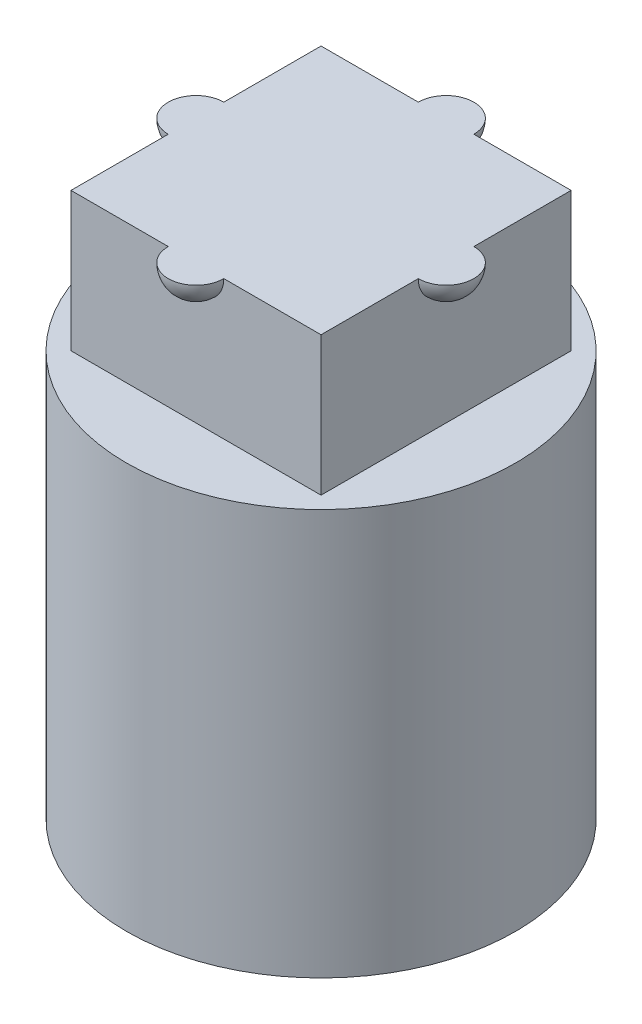
ISO-10303-21;
HEADER;
FILE_DESCRIPTION(('STEP AP214'),'2;1');
FILE_NAME('part.step','',(''),(''),'','','');
FILE_SCHEMA(('AUTOMOTIVE_DESIGN { 1 0 10303 214 1 1 1 1 }'));
ENDSEC;
DATA;
#1=APPLICATION_CONTEXT('core data for automotive mechanical design processes');
#2=APPLICATION_PROTOCOL_DEFINITION('international standard','automotive_design',2000,#1);
#3=PRODUCT_CONTEXT('',#1,'mechanical');
#4=PRODUCT('Part','Part','',(#3));
#5=PRODUCT_RELATED_PRODUCT_CATEGORY('part','',(#4));
#6=PRODUCT_DEFINITION_FORMATION('','',#4);
#7=PRODUCT_DEFINITION_CONTEXT('part definition',#1,'design');
#8=PRODUCT_DEFINITION('design','',#6,#7);
#9=PRODUCT_DEFINITION_SHAPE('','',#8);
#10=(LENGTH_UNIT() NAMED_UNIT(*) SI_UNIT(.MILLI.,.METRE.));
#11=(NAMED_UNIT(*) PLANE_ANGLE_UNIT() SI_UNIT($,.RADIAN.));
#12=(NAMED_UNIT(*) SI_UNIT($,.STERADIAN.) SOLID_ANGLE_UNIT());
#13=UNCERTAINTY_MEASURE_WITH_UNIT(LENGTH_MEASURE(1.E-05),#10,'distance_accuracy_value','');
#14=(GEOMETRIC_REPRESENTATION_CONTEXT(3) GLOBAL_UNCERTAINTY_ASSIGNED_CONTEXT((#13)) GLOBAL_UNIT_ASSIGNED_CONTEXT((#10,
#11,#12)) REPRESENTATION_CONTEXT('',''));
#15=CARTESIAN_POINT('',(0.,0.,0.));
#16=DIRECTION('',(0.,0.,1.));
#17=DIRECTION('',(1.,0.,0.));
#18=AXIS2_PLACEMENT_3D('',#15,#16,#17);
#19=CARTESIAN_POINT('',(2.25,9.8,0.));
#20=DIRECTION('',(-1.,0.,0.));
#21=DIRECTION('',(0.,0.,1.));
#22=AXIS2_PLACEMENT_3D('',#19,#20,#21);
#23=SPHERICAL_SURFACE('',#22,0.5);
#24=CARTESIAN_POINT('',(2.25,9.8,0.));
#25=DIRECTION('',(-1.,0.,0.));
#26=DIRECTION('',(0.,0.,1.));
#27=AXIS2_PLACEMENT_3D('',#24,#25,#26);
#28=CIRCLE('',#27,0.5);
#29=CARTESIAN_POINT('',(2.25,9.8,-0.5));
#30=VERTEX_POINT('',#29);
#31=CARTESIAN_POINT('',(2.25,9.8,0.5));
#32=VERTEX_POINT('',#31);
#33=EDGE_CURVE('E173',#30,#32,#28,.T.);
#34=ORIENTED_EDGE('',*,*,#33,.F.);
#35=CARTESIAN_POINT('',(2.25,9.8,0.));
#36=DIRECTION('',(0.,1.,0.));
#37=DIRECTION('',(0.,0.,1.));
#38=AXIS2_PLACEMENT_3D('',#35,#36,#37);
#39=CIRCLE('',#38,0.5);
#40=EDGE_CURVE('E484',#30,#32,#39,.F.);
#41=ORIENTED_EDGE('',*,*,#40,.T.);
#42=EDGE_LOOP('',(#34,#41));
#43=FACE_BOUND('',#42,.T.);
#44=ADVANCED_FACE('F35',(#43),#23,.T.);
#45=CARTESIAN_POINT('',(-2.25,9.8,0.));
#46=DIRECTION('',(-1.,0.,0.));
#47=DIRECTION('',(0.,0.,1.));
#48=AXIS2_PLACEMENT_3D('',#45,#46,#47);
#49=SPHERICAL_SURFACE('',#48,0.5);
#50=CARTESIAN_POINT('',(-2.25,9.8,0.));
#51=DIRECTION('',(1.,0.,0.));
#52=DIRECTION('',(0.,0.,-1.));
#53=AXIS2_PLACEMENT_3D('',#50,#51,#52);
#54=CIRCLE('',#53,0.5);
#55=CARTESIAN_POINT('',(-2.25,9.8,0.5));
#56=VERTEX_POINT('',#55);
#57=CARTESIAN_POINT('',(-2.25,9.8,-0.5));
#58=VERTEX_POINT('',#57);
#59=EDGE_CURVE('E491',#56,#58,#54,.T.);
#60=ORIENTED_EDGE('',*,*,#59,.F.);
#61=CARTESIAN_POINT('',(-2.25,9.8,0.));
#62=DIRECTION('',(0.,1.,0.));
#63=DIRECTION('',(0.,0.,1.));
#64=AXIS2_PLACEMENT_3D('',#61,#62,#63);
#65=CIRCLE('',#64,0.5);
#66=EDGE_CURVE('E57',#56,#58,#65,.F.);
#67=ORIENTED_EDGE('',*,*,#66,.T.);
#68=EDGE_LOOP('',(#60,#67));
#69=FACE_BOUND('',#68,.T.);
#70=ADVANCED_FACE('F307',(#69),#49,.T.);
#71=CARTESIAN_POINT('',(0.,9.8,-2.25));
#72=DIRECTION('',(0.,0.,1.));
#73=DIRECTION('',(1.,0.,0.));
#74=AXIS2_PLACEMENT_3D('',#71,#72,#73);
#75=SPHERICAL_SURFACE('',#74,0.5);
#76=CARTESIAN_POINT('',(0.,9.8,-2.25));
#77=DIRECTION('',(0.,1.,0.));
#78=DIRECTION('',(0.,0.,1.));
#79=AXIS2_PLACEMENT_3D('',#76,#77,#78);
#80=CIRCLE('',#79,0.5);
#81=CARTESIAN_POINT('',(0.499999999999999,9.8,-2.25));
#82=VERTEX_POINT('',#81);
#83=CARTESIAN_POINT('',(-0.500000000000001,9.8,-2.25));
#84=VERTEX_POINT('',#83);
#85=EDGE_CURVE('E50',#82,#84,#80,.T.);
#86=ORIENTED_EDGE('',*,*,#85,.F.);
#87=CARTESIAN_POINT('',(0.,9.8,-2.25));
#88=DIRECTION('',(0.,0.,1.));
#89=DIRECTION('',(1.,0.,0.));
#90=AXIS2_PLACEMENT_3D('',#87,#88,#89);
#91=CIRCLE('',#90,0.5);
#92=EDGE_CURVE('E157',#82,#84,#91,.F.);
#93=ORIENTED_EDGE('',*,*,#92,.T.);
#94=EDGE_LOOP('',(#86,#93));
#95=FACE_BOUND('',#94,.T.);
#96=ADVANCED_FACE('F313',(#95),#75,.T.);
#97=CARTESIAN_POINT('',(0.,9.8,2.25));
#98=DIRECTION('',(0.,0.,1.));
#99=DIRECTION('',(1.,0.,0.));
#100=AXIS2_PLACEMENT_3D('',#97,#98,#99);
#101=SPHERICAL_SURFACE('',#100,0.5);
#102=CARTESIAN_POINT('',(0.,9.8,2.25));
#103=DIRECTION('',(0.,1.,0.));
#104=DIRECTION('',(0.,0.,1.));
#105=AXIS2_PLACEMENT_3D('',#102,#103,#104);
#106=CIRCLE('',#105,0.5);
#107=CARTESIAN_POINT('',(-0.500000000000001,9.8,2.25));
#108=VERTEX_POINT('',#107);
#109=CARTESIAN_POINT('',(0.499999999999999,9.8,2.25));
#110=VERTEX_POINT('',#109);
#111=EDGE_CURVE('E11',#108,#110,#106,.T.);
#112=ORIENTED_EDGE('',*,*,#111,.F.);
#113=CARTESIAN_POINT('',(0.,9.8,2.25));
#114=DIRECTION('',(0.,0.,-1.));
#115=DIRECTION('',(-1.,0.,0.));
#116=AXIS2_PLACEMENT_3D('',#113,#114,#115);
#117=CIRCLE('',#116,0.5);
#118=EDGE_CURVE('E154',#108,#110,#117,.F.);
#119=ORIENTED_EDGE('',*,*,#118,.T.);
#120=EDGE_LOOP('',(#112,#119));
#121=FACE_BOUND('',#120,.T.);
#122=ADVANCED_FACE('F155',(#121),#101,.T.);
#123=CARTESIAN_POINT('',(0.,7.3,0.));
#124=DIRECTION('',(0.,1.,0.));
#125=DIRECTION('',(0.,0.,1.));
#126=AXIS2_PLACEMENT_3D('',#123,#124,#125);
#127=PLANE('',#126);
#128=CARTESIAN_POINT('',(0.,7.3,0.));
#129=DIRECTION('',(0.,1.,0.));
#130=DIRECTION('',(0.,0.,1.));
#131=AXIS2_PLACEMENT_3D('',#128,#129,#130);
#132=CIRCLE('',#131,3.5);
#133=CARTESIAN_POINT('',(0.,7.3,3.5));
#134=VERTEX_POINT('',#133);
#135=EDGE_CURVE('E189',#134,#134,#132,.T.);
#136=ORIENTED_EDGE('',*,*,#135,.T.);
#137=EDGE_LOOP('',(#136));
#138=FACE_BOUND('',#137,.T.);
#139=DIRECTION('',(-1.,0.,0.));
#140=VECTOR('',#139,1.);
#141=CARTESIAN_POINT('',(-2.25,7.3,-2.25));
#142=LINE('',#141,#140);
#143=CARTESIAN_POINT('',(2.25,7.3,-2.25));
#144=VERTEX_POINT('',#143);
#145=CARTESIAN_POINT('',(-2.25,7.3,-2.25));
#146=VERTEX_POINT('',#145);
#147=EDGE_CURVE('E172',#144,#146,#142,.T.);
#148=ORIENTED_EDGE('',*,*,#147,.F.);
#149=DIRECTION('',(0.,0.,-1.));
#150=VECTOR('',#149,1.);
#151=CARTESIAN_POINT('',(2.25,7.3,-2.25));
#152=LINE('',#151,#150);
#153=CARTESIAN_POINT('',(2.25,7.3,2.25));
#154=VERTEX_POINT('',#153);
#155=EDGE_CURVE('E169',#154,#144,#152,.T.);
#156=ORIENTED_EDGE('',*,*,#155,.F.);
#157=DIRECTION('',(1.,0.,0.));
#158=VECTOR('',#157,1.);
#159=CARTESIAN_POINT('',(-2.25,7.3,2.25));
#160=LINE('',#159,#158);
#161=CARTESIAN_POINT('',(-2.25,7.3,2.25));
#162=VERTEX_POINT('',#161);
#163=EDGE_CURVE('E178',#162,#154,#160,.T.);
#164=ORIENTED_EDGE('',*,*,#163,.F.);
#165=DIRECTION('',(0.,0.,1.));
#166=VECTOR('',#165,1.);
#167=CARTESIAN_POINT('',(-2.25,7.3,-2.25));
#168=LINE('',#167,#166);
#169=EDGE_CURVE('E175',#146,#162,#168,.T.);
#170=ORIENTED_EDGE('',*,*,#169,.F.);
#171=EDGE_LOOP('',(#148,#156,#164,#170));
#172=FACE_BOUND('',#171,.T.);
#173=ADVANCED_FACE('F265',(#138,#172),#127,.T.);
#174=CARTESIAN_POINT('',(0.,0.,0.));
#175=DIRECTION('',(0.,1.,0.));
#176=DIRECTION('',(0.,0.,1.));
#177=AXIS2_PLACEMENT_3D('',#174,#175,#176);
#178=PLANE('',#177);
#179=CARTESIAN_POINT('',(0.,0.,0.));
#180=DIRECTION('',(0.,1.,0.));
#181=DIRECTION('',(0.,0.,1.));
#182=AXIS2_PLACEMENT_3D('',#179,#180,#181);
#183=CIRCLE('',#182,3.5);
#184=CARTESIAN_POINT('',(0.,0.,3.5));
#185=VERTEX_POINT('',#184);
#186=EDGE_CURVE('E43',#185,#185,#183,.T.);
#187=ORIENTED_EDGE('',*,*,#186,.F.);
#188=EDGE_LOOP('',(#187));
#189=FACE_BOUND('',#188,.T.);
#190=CARTESIAN_POINT('',(1.2,0.,-1.2));
#191=DIRECTION('',(0.,1.,0.));
#192=DIRECTION('',(0.,0.,1.));
#193=AXIS2_PLACEMENT_3D('',#190,#191,#192);
#194=CIRCLE('',#193,0.25);
#195=CARTESIAN_POINT('',(1.2,0.,-0.950000000000001));
#196=VERTEX_POINT('',#195);
#197=CARTESIAN_POINT('',(0.95,0.,-1.2));
#198=VERTEX_POINT('',#197);
#199=EDGE_CURVE('E192',#196,#198,#194,.T.);
#200=ORIENTED_EDGE('',*,*,#199,.T.);
#201=DIRECTION('',(-1.,0.,0.));
#202=VECTOR('',#201,1.);
#203=CARTESIAN_POINT('',(0.95,0.,-1.2));
#204=LINE('',#203,#202);
#205=CARTESIAN_POINT('',(-0.95,0.,-1.2));
#206=VERTEX_POINT('',#205);
#207=EDGE_CURVE('E221',#198,#206,#204,.T.);
#208=ORIENTED_EDGE('',*,*,#207,.T.);
#209=CARTESIAN_POINT('',(-1.2,0.,-1.2));
#210=DIRECTION('',(0.,1.,0.));
#211=DIRECTION('',(0.,0.,1.));
#212=AXIS2_PLACEMENT_3D('',#209,#210,#211);
#213=CIRCLE('',#212,0.25);
#214=CARTESIAN_POINT('',(-1.2,0.,-0.95));
#215=VERTEX_POINT('',#214);
#216=EDGE_CURVE('E224',#206,#215,#213,.T.);
#217=ORIENTED_EDGE('',*,*,#216,.T.);
#218=DIRECTION('',(0.,0.,1.));
#219=VECTOR('',#218,1.);
#220=CARTESIAN_POINT('',(-1.2,0.,0.95));
#221=LINE('',#220,#219);
#222=CARTESIAN_POINT('',(-1.2,0.,0.95));
#223=VERTEX_POINT('',#222);
#224=EDGE_CURVE('E227',#215,#223,#221,.T.);
#225=ORIENTED_EDGE('',*,*,#224,.T.);
#226=CARTESIAN_POINT('',(-1.2,0.,1.2));
#227=DIRECTION('',(0.,1.,0.));
#228=DIRECTION('',(0.,0.,1.));
#229=AXIS2_PLACEMENT_3D('',#226,#227,#228);
#230=CIRCLE('',#229,0.25);
#231=CARTESIAN_POINT('',(-0.95,0.,1.2));
#232=VERTEX_POINT('',#231);
#233=EDGE_CURVE('E230',#223,#232,#230,.T.);
#234=ORIENTED_EDGE('',*,*,#233,.T.);
#235=DIRECTION('',(1.,0.,0.));
#236=VECTOR('',#235,1.);
#237=CARTESIAN_POINT('',(0.95,0.,1.2));
#238=LINE('',#237,#236);
#239=CARTESIAN_POINT('',(0.95,0.,1.2));
#240=VERTEX_POINT('',#239);
#241=EDGE_CURVE('E233',#232,#240,#238,.T.);
#242=ORIENTED_EDGE('',*,*,#241,.T.);
#243=CARTESIAN_POINT('',(1.2,0.,1.2));
#244=DIRECTION('',(0.,1.,0.));
#245=DIRECTION('',(0.,0.,1.));
#246=AXIS2_PLACEMENT_3D('',#243,#244,#245);
#247=CIRCLE('',#246,0.25);
#248=CARTESIAN_POINT('',(1.2,0.,0.949999999999999));
#249=VERTEX_POINT('',#248);
#250=EDGE_CURVE('E236',#240,#249,#247,.T.);
#251=ORIENTED_EDGE('',*,*,#250,.T.);
#252=DIRECTION('',(0.,0.,-1.));
#253=VECTOR('',#252,1.);
#254=CARTESIAN_POINT('',(1.2,0.,0.949999999999999));
#255=LINE('',#254,#253);
#256=EDGE_CURVE('E197',#249,#196,#255,.T.);
#257=ORIENTED_EDGE('',*,*,#256,.T.);
#258=EDGE_LOOP('',(#200,#208,#217,#225,#234,#242,#251,#257));
#259=FACE_BOUND('',#258,.T.);
#260=ADVANCED_FACE('F262',(#189,#259),#178,.F.);
#261=CARTESIAN_POINT('',(0.,4.,0.));
#262=DIRECTION('',(0.,-1.,0.));
#263=DIRECTION('',(0.,0.,-1.));
#264=AXIS2_PLACEMENT_3D('',#261,#262,#263);
#265=CYLINDRICAL_SURFACE('',#264,3.5);
#266=ORIENTED_EDGE('',*,*,#186,.T.);
#267=EDGE_LOOP('',(#266));
#268=FACE_BOUND('',#267,.T.);
#269=ORIENTED_EDGE('',*,*,#135,.F.);
#270=EDGE_LOOP('',(#269));
#271=FACE_BOUND('',#270,.T.);
#272=ADVANCED_FACE('F37',(#268,#271),#265,.T.);
#273=CARTESIAN_POINT('',(1.2,4.,-1.2));
#274=DIRECTION('',(0.,-1.,0.));
#275=DIRECTION('',(0.,0.,-1.));
#276=AXIS2_PLACEMENT_3D('',#273,#274,#275);
#277=CYLINDRICAL_SURFACE('',#276,0.25);
#278=ORIENTED_EDGE('',*,*,#199,.F.);
#279=DIRECTION('',(0.,-1.,0.));
#280=VECTOR('',#279,1.);
#281=CARTESIAN_POINT('',(1.2,4.,-0.950000000000001));
#282=LINE('',#281,#280);
#283=CARTESIAN_POINT('',(1.2,4.,-0.950000000000001));
#284=VERTEX_POINT('',#283);
#285=EDGE_CURVE('E218',#284,#196,#282,.T.);
#286=ORIENTED_EDGE('',*,*,#285,.F.);
#287=CARTESIAN_POINT('',(1.2,4.,-1.2));
#288=DIRECTION('',(0.,1.,0.));
#289=DIRECTION('',(0.,0.,1.));
#290=AXIS2_PLACEMENT_3D('',#287,#288,#289);
#291=CIRCLE('',#290,0.25);
#292=CARTESIAN_POINT('',(0.95,4.,-1.2));
#293=VERTEX_POINT('',#292);
#294=EDGE_CURVE('E193',#284,#293,#291,.T.);
#295=ORIENTED_EDGE('',*,*,#294,.T.);
#296=DIRECTION('',(0.,-1.,0.));
#297=VECTOR('',#296,1.);
#298=CARTESIAN_POINT('',(0.95,4.,-1.2));
#299=LINE('',#298,#297);
#300=EDGE_CURVE('E255',#293,#198,#299,.T.);
#301=ORIENTED_EDGE('',*,*,#300,.T.);
#302=EDGE_LOOP('',(#278,#286,#295,#301));
#303=FACE_BOUND('',#302,.T.);
#304=ADVANCED_FACE('F269',(#303),#277,.F.);
#305=CARTESIAN_POINT('',(0.95,4.,-1.2));
#306=DIRECTION('',(0.,0.,1.));
#307=DIRECTION('',(1.,0.,0.));
#308=AXIS2_PLACEMENT_3D('',#305,#306,#307);
#309=PLANE('',#308);
#310=ORIENTED_EDGE('',*,*,#207,.F.);
#311=ORIENTED_EDGE('',*,*,#300,.F.);
#312=DIRECTION('',(-1.,0.,0.));
#313=VECTOR('',#312,1.);
#314=CARTESIAN_POINT('',(0.95,4.,-1.2));
#315=LINE('',#314,#313);
#316=CARTESIAN_POINT('',(-0.95,4.,-1.2));
#317=VERTEX_POINT('',#316);
#318=EDGE_CURVE('E196',#293,#317,#315,.T.);
#319=ORIENTED_EDGE('',*,*,#318,.T.);
#320=DIRECTION('',(0.,-1.,0.));
#321=VECTOR('',#320,1.);
#322=CARTESIAN_POINT('',(-0.95,4.,-1.2));
#323=LINE('',#322,#321);
#324=EDGE_CURVE('E253',#317,#206,#323,.T.);
#325=ORIENTED_EDGE('',*,*,#324,.T.);
#326=EDGE_LOOP('',(#310,#311,#319,#325));
#327=FACE_BOUND('',#326,.T.);
#328=ADVANCED_FACE('F277',(#327),#309,.T.);
#329=CARTESIAN_POINT('',(-1.2,4.,-1.2));
#330=DIRECTION('',(0.,-1.,0.));
#331=DIRECTION('',(0.,0.,-1.));
#332=AXIS2_PLACEMENT_3D('',#329,#330,#331);
#333=CYLINDRICAL_SURFACE('',#332,0.25);
#334=ORIENTED_EDGE('',*,*,#216,.F.);
#335=ORIENTED_EDGE('',*,*,#324,.F.);
#336=CARTESIAN_POINT('',(-1.2,4.,-1.2));
#337=DIRECTION('',(0.,1.,0.));
#338=DIRECTION('',(0.,0.,1.));
#339=AXIS2_PLACEMENT_3D('',#336,#337,#338);
#340=CIRCLE('',#339,0.25);
#341=CARTESIAN_POINT('',(-1.2,4.,-0.95));
#342=VERTEX_POINT('',#341);
#343=EDGE_CURVE('E200',#317,#342,#340,.T.);
#344=ORIENTED_EDGE('',*,*,#343,.T.);
#345=DIRECTION('',(0.,-1.,0.));
#346=VECTOR('',#345,1.);
#347=CARTESIAN_POINT('',(-1.2,4.,-0.95));
#348=LINE('',#347,#346);
#349=EDGE_CURVE('E251',#342,#215,#348,.T.);
#350=ORIENTED_EDGE('',*,*,#349,.T.);
#351=EDGE_LOOP('',(#334,#335,#344,#350));
#352=FACE_BOUND('',#351,.T.);
#353=ADVANCED_FACE('F281',(#352),#333,.F.);
#354=CARTESIAN_POINT('',(-1.2,4.,0.95));
#355=DIRECTION('',(1.,0.,0.));
#356=DIRECTION('',(0.,0.,-1.));
#357=AXIS2_PLACEMENT_3D('',#354,#355,#356);
#358=PLANE('',#357);
#359=ORIENTED_EDGE('',*,*,#224,.F.);
#360=ORIENTED_EDGE('',*,*,#349,.F.);
#361=DIRECTION('',(0.,0.,1.));
#362=VECTOR('',#361,1.);
#363=CARTESIAN_POINT('',(-1.2,4.,0.95));
#364=LINE('',#363,#362);
#365=CARTESIAN_POINT('',(-1.2,4.,0.95));
#366=VERTEX_POINT('',#365);
#367=EDGE_CURVE('E203',#342,#366,#364,.T.);
#368=ORIENTED_EDGE('',*,*,#367,.T.);
#369=DIRECTION('',(0.,-1.,0.));
#370=VECTOR('',#369,1.);
#371=CARTESIAN_POINT('',(-1.2,4.,0.95));
#372=LINE('',#371,#370);
#373=EDGE_CURVE('E249',#366,#223,#372,.T.);
#374=ORIENTED_EDGE('',*,*,#373,.T.);
#375=EDGE_LOOP('',(#359,#360,#368,#374));
#376=FACE_BOUND('',#375,.T.);
#377=ADVANCED_FACE('F286',(#376),#358,.T.);
#378=CARTESIAN_POINT('',(-1.2,4.,1.2));
#379=DIRECTION('',(0.,-1.,0.));
#380=DIRECTION('',(0.,0.,-1.));
#381=AXIS2_PLACEMENT_3D('',#378,#379,#380);
#382=CYLINDRICAL_SURFACE('',#381,0.25);
#383=ORIENTED_EDGE('',*,*,#233,.F.);
#384=ORIENTED_EDGE('',*,*,#373,.F.);
#385=CARTESIAN_POINT('',(-1.2,4.,1.2));
#386=DIRECTION('',(0.,1.,0.));
#387=DIRECTION('',(0.,0.,1.));
#388=AXIS2_PLACEMENT_3D('',#385,#386,#387);
#389=CIRCLE('',#388,0.25);
#390=CARTESIAN_POINT('',(-0.95,4.,1.2));
#391=VERTEX_POINT('',#390);
#392=EDGE_CURVE('E206',#366,#391,#389,.T.);
#393=ORIENTED_EDGE('',*,*,#392,.T.);
#394=DIRECTION('',(0.,-1.,0.));
#395=VECTOR('',#394,1.);
#396=CARTESIAN_POINT('',(-0.95,4.,1.2));
#397=LINE('',#396,#395);
#398=EDGE_CURVE('E247',#391,#232,#397,.T.);
#399=ORIENTED_EDGE('',*,*,#398,.T.);
#400=EDGE_LOOP('',(#383,#384,#393,#399));
#401=FACE_BOUND('',#400,.T.);
#402=ADVANCED_FACE('F289',(#401),#382,.F.);
#403=CARTESIAN_POINT('',(0.95,4.,1.2));
#404=DIRECTION('',(0.,0.,-1.));
#405=DIRECTION('',(-1.,0.,0.));
#406=AXIS2_PLACEMENT_3D('',#403,#404,#405);
#407=PLANE('',#406);
#408=ORIENTED_EDGE('',*,*,#241,.F.);
#409=ORIENTED_EDGE('',*,*,#398,.F.);
#410=DIRECTION('',(1.,0.,0.));
#411=VECTOR('',#410,1.);
#412=CARTESIAN_POINT('',(0.95,4.,1.2));
#413=LINE('',#412,#411);
#414=CARTESIAN_POINT('',(0.95,4.,1.2));
#415=VERTEX_POINT('',#414);
#416=EDGE_CURVE('E209',#391,#415,#413,.T.);
#417=ORIENTED_EDGE('',*,*,#416,.T.);
#418=DIRECTION('',(0.,-1.,0.));
#419=VECTOR('',#418,1.);
#420=CARTESIAN_POINT('',(0.95,4.,1.2));
#421=LINE('',#420,#419);
#422=EDGE_CURVE('E245',#415,#240,#421,.T.);
#423=ORIENTED_EDGE('',*,*,#422,.T.);
#424=EDGE_LOOP('',(#408,#409,#417,#423));
#425=FACE_BOUND('',#424,.T.);
#426=ADVANCED_FACE('F293',(#425),#407,.T.);
#427=CARTESIAN_POINT('',(1.2,4.,1.2));
#428=DIRECTION('',(0.,-1.,0.));
#429=DIRECTION('',(0.,0.,-1.));
#430=AXIS2_PLACEMENT_3D('',#427,#428,#429);
#431=CYLINDRICAL_SURFACE('',#430,0.25);
#432=ORIENTED_EDGE('',*,*,#250,.F.);
#433=ORIENTED_EDGE('',*,*,#422,.F.);
#434=CARTESIAN_POINT('',(1.2,4.,1.2));
#435=DIRECTION('',(0.,1.,0.));
#436=DIRECTION('',(0.,0.,1.));
#437=AXIS2_PLACEMENT_3D('',#434,#435,#436);
#438=CIRCLE('',#437,0.25);
#439=CARTESIAN_POINT('',(1.2,4.,0.949999999999999));
#440=VERTEX_POINT('',#439);
#441=EDGE_CURVE('E212',#415,#440,#438,.T.);
#442=ORIENTED_EDGE('',*,*,#441,.T.);
#443=DIRECTION('',(0.,-1.,0.));
#444=VECTOR('',#443,1.);
#445=CARTESIAN_POINT('',(1.2,4.,0.949999999999999));
#446=LINE('',#445,#444);
#447=EDGE_CURVE('E243',#440,#249,#446,.T.);
#448=ORIENTED_EDGE('',*,*,#447,.T.);
#449=EDGE_LOOP('',(#432,#433,#442,#448));
#450=FACE_BOUND('',#449,.T.);
#451=ADVANCED_FACE('F297',(#450),#431,.F.);
#452=CARTESIAN_POINT('',(1.2,4.,0.949999999999999));
#453=DIRECTION('',(-1.,0.,0.));
#454=DIRECTION('',(0.,0.,1.));
#455=AXIS2_PLACEMENT_3D('',#452,#453,#454);
#456=PLANE('',#455);
#457=ORIENTED_EDGE('',*,*,#256,.F.);
#458=ORIENTED_EDGE('',*,*,#447,.F.);
#459=DIRECTION('',(0.,0.,-1.));
#460=VECTOR('',#459,1.);
#461=CARTESIAN_POINT('',(1.2,4.,0.949999999999999));
#462=LINE('',#461,#460);
#463=EDGE_CURVE('E215',#440,#284,#462,.T.);
#464=ORIENTED_EDGE('',*,*,#463,.T.);
#465=ORIENTED_EDGE('',*,*,#285,.T.);
#466=EDGE_LOOP('',(#457,#458,#464,#465));
#467=FACE_BOUND('',#466,.T.);
#468=ADVANCED_FACE('F272',(#467),#456,.T.);
#469=CARTESIAN_POINT('',(0.,4.,0.));
#470=DIRECTION('',(0.,1.,0.));
#471=DIRECTION('',(0.,0.,1.));
#472=AXIS2_PLACEMENT_3D('',#469,#470,#471);
#473=PLANE('',#472);
#474=ORIENTED_EDGE('',*,*,#294,.F.);
#475=ORIENTED_EDGE('',*,*,#463,.F.);
#476=ORIENTED_EDGE('',*,*,#441,.F.);
#477=ORIENTED_EDGE('',*,*,#416,.F.);
#478=ORIENTED_EDGE('',*,*,#392,.F.);
#479=ORIENTED_EDGE('',*,*,#367,.F.);
#480=ORIENTED_EDGE('',*,*,#343,.F.);
#481=ORIENTED_EDGE('',*,*,#318,.F.);
#482=EDGE_LOOP('',(#474,#475,#476,#477,#478,#479,#480,#481));
#483=FACE_BOUND('',#482,.T.);
#484=ADVANCED_FACE('F275',(#483),#473,.F.);
#485=CARTESIAN_POINT('',(2.25,9.8,-2.25));
#486=DIRECTION('',(-1.,0.,0.));
#487=DIRECTION('',(0.,0.,1.));
#488=AXIS2_PLACEMENT_3D('',#485,#486,#487);
#489=PLANE('',#488);
#490=DIRECTION('',(0.,0.,-1.));
#491=VECTOR('',#490,1.);
#492=CARTESIAN_POINT('',(2.25,9.8,-2.25));
#493=LINE('',#492,#491);
#494=CARTESIAN_POINT('',(2.25,9.8,-2.25));
#495=VERTEX_POINT('',#494);
#496=EDGE_CURVE('E180',#30,#495,#493,.T.);
#497=ORIENTED_EDGE('',*,*,#496,.F.);
#498=ORIENTED_EDGE('',*,*,#33,.T.);
#499=CARTESIAN_POINT('',(2.25,9.8,2.25));
#500=VERTEX_POINT('',#499);
#501=EDGE_CURVE('E494',#500,#32,#493,.T.);
#502=ORIENTED_EDGE('',*,*,#501,.F.);
#503=DIRECTION('',(0.,-1.,0.));
#504=VECTOR('',#503,1.);
#505=CARTESIAN_POINT('',(2.25,9.8,2.25));
#506=LINE('',#505,#504);
#507=EDGE_CURVE('E161',#500,#154,#506,.T.);
#508=ORIENTED_EDGE('',*,*,#507,.T.);
#509=ORIENTED_EDGE('',*,*,#155,.T.);
#510=DIRECTION('',(0.,-1.,0.));
#511=VECTOR('',#510,1.);
#512=CARTESIAN_POINT('',(2.25,9.8,-2.25));
#513=LINE('',#512,#511);
#514=EDGE_CURVE('E187',#495,#144,#513,.T.);
#515=ORIENTED_EDGE('',*,*,#514,.F.);
#516=EDGE_LOOP('',(#497,#498,#502,#508,#509,#515));
#517=FACE_BOUND('',#516,.T.);
#518=ADVANCED_FACE('F330',(#517),#489,.F.);
#519=CARTESIAN_POINT('',(-2.25,9.8,-2.25));
#520=DIRECTION('',(0.,0.,1.));
#521=DIRECTION('',(1.,0.,0.));
#522=AXIS2_PLACEMENT_3D('',#519,#520,#521);
#523=PLANE('',#522);
#524=ORIENTED_EDGE('',*,*,#92,.F.);
#525=DIRECTION('',(-1.,0.,0.));
#526=VECTOR('',#525,1.);
#527=CARTESIAN_POINT('',(-2.25,9.8,-2.25));
#528=LINE('',#527,#526);
#529=EDGE_CURVE('E487',#495,#82,#528,.T.);
#530=ORIENTED_EDGE('',*,*,#529,.F.);
#531=ORIENTED_EDGE('',*,*,#514,.T.);
#532=ORIENTED_EDGE('',*,*,#147,.T.);
#533=DIRECTION('',(0.,-1.,0.));
#534=VECTOR('',#533,1.);
#535=CARTESIAN_POINT('',(-2.25,9.8,-2.25));
#536=LINE('',#535,#534);
#537=CARTESIAN_POINT('',(-2.25,9.8,-2.25));
#538=VERTEX_POINT('',#537);
#539=EDGE_CURVE('E184',#538,#146,#536,.T.);
#540=ORIENTED_EDGE('',*,*,#539,.F.);
#541=EDGE_CURVE('E490',#84,#538,#528,.T.);
#542=ORIENTED_EDGE('',*,*,#541,.F.);
#543=EDGE_LOOP('',(#524,#530,#531,#532,#540,#542));
#544=FACE_BOUND('',#543,.T.);
#545=ADVANCED_FACE('F326',(#544),#523,.F.);
#546=CARTESIAN_POINT('',(-2.25,9.8,-2.25));
#547=DIRECTION('',(1.,0.,0.));
#548=DIRECTION('',(0.,0.,-1.));
#549=AXIS2_PLACEMENT_3D('',#546,#547,#548);
#550=PLANE('',#549);
#551=DIRECTION('',(0.,0.,1.));
#552=VECTOR('',#551,1.);
#553=CARTESIAN_POINT('',(-2.25,9.8,-2.25));
#554=LINE('',#553,#552);
#555=CARTESIAN_POINT('',(-2.25,9.8,2.25));
#556=VERTEX_POINT('',#555);
#557=EDGE_CURVE('E165',#56,#556,#554,.T.);
#558=ORIENTED_EDGE('',*,*,#557,.F.);
#559=ORIENTED_EDGE('',*,*,#59,.T.);
#560=EDGE_CURVE('E163',#538,#58,#554,.T.);
#561=ORIENTED_EDGE('',*,*,#560,.F.);
#562=ORIENTED_EDGE('',*,*,#539,.T.);
#563=ORIENTED_EDGE('',*,*,#169,.T.);
#564=DIRECTION('',(0.,-1.,0.));
#565=VECTOR('',#564,1.);
#566=CARTESIAN_POINT('',(-2.25,9.8,2.25));
#567=LINE('',#566,#565);
#568=EDGE_CURVE('E182',#556,#162,#567,.T.);
#569=ORIENTED_EDGE('',*,*,#568,.F.);
#570=EDGE_LOOP('',(#558,#559,#561,#562,#563,#569));
#571=FACE_BOUND('',#570,.T.);
#572=ADVANCED_FACE('F323',(#571),#550,.F.);
#573=CARTESIAN_POINT('',(-2.25,9.8,2.25));
#574=DIRECTION('',(0.,0.,-1.));
#575=DIRECTION('',(-1.,0.,0.));
#576=AXIS2_PLACEMENT_3D('',#573,#574,#575);
#577=PLANE('',#576);
#578=ORIENTED_EDGE('',*,*,#118,.F.);
#579=DIRECTION('',(1.,0.,0.));
#580=VECTOR('',#579,1.);
#581=CARTESIAN_POINT('',(-2.25,9.8,2.25));
#582=LINE('',#581,#580);
#583=EDGE_CURVE('E151',#556,#108,#582,.T.);
#584=ORIENTED_EDGE('',*,*,#583,.F.);
#585=ORIENTED_EDGE('',*,*,#568,.T.);
#586=ORIENTED_EDGE('',*,*,#163,.T.);
#587=ORIENTED_EDGE('',*,*,#507,.F.);
#588=EDGE_CURVE('E148',#110,#500,#582,.T.);
#589=ORIENTED_EDGE('',*,*,#588,.F.);
#590=EDGE_LOOP('',(#578,#584,#585,#586,#587,#589));
#591=FACE_BOUND('',#590,.T.);
#592=ADVANCED_FACE('F159',(#591),#577,.F.);
#593=CARTESIAN_POINT('',(0.,9.8,0.));
#594=DIRECTION('',(0.,1.,0.));
#595=DIRECTION('',(0.,0.,1.));
#596=AXIS2_PLACEMENT_3D('',#593,#594,#595);
#597=PLANE('',#596);
#598=ORIENTED_EDGE('',*,*,#583,.T.);
#599=ORIENTED_EDGE('',*,*,#111,.T.);
#600=ORIENTED_EDGE('',*,*,#588,.T.);
#601=ORIENTED_EDGE('',*,*,#501,.T.);
#602=ORIENTED_EDGE('',*,*,#40,.F.);
#603=ORIENTED_EDGE('',*,*,#496,.T.);
#604=ORIENTED_EDGE('',*,*,#529,.T.);
#605=ORIENTED_EDGE('',*,*,#85,.T.);
#606=ORIENTED_EDGE('',*,*,#541,.T.);
#607=ORIENTED_EDGE('',*,*,#560,.T.);
#608=ORIENTED_EDGE('',*,*,#66,.F.);
#609=ORIENTED_EDGE('',*,*,#557,.T.);
#610=EDGE_LOOP('',(#598,#599,#600,#601,#602,#603,#604,#605,#606,#607,#608,#609));
#611=FACE_BOUND('',#610,.T.);
#612=ADVANCED_FACE('F145',(#611),#597,.T.);
#613=CLOSED_SHELL('',(#44,#70,#96,#122,#173,#260,#272,#304,#328,#353,#377,#402,#426,#451,#468,
#484,#518,#545,#572,#592,#612));
#614=MANIFOLD_SOLID_BREP('B2',#613);
#615=ADVANCED_BREP_SHAPE_REPRESENTATION('',(#18,#614),#14);
#616=SHAPE_DEFINITION_REPRESENTATION(#9,#615);
ENDSEC;
END-ISO-10303-21;
